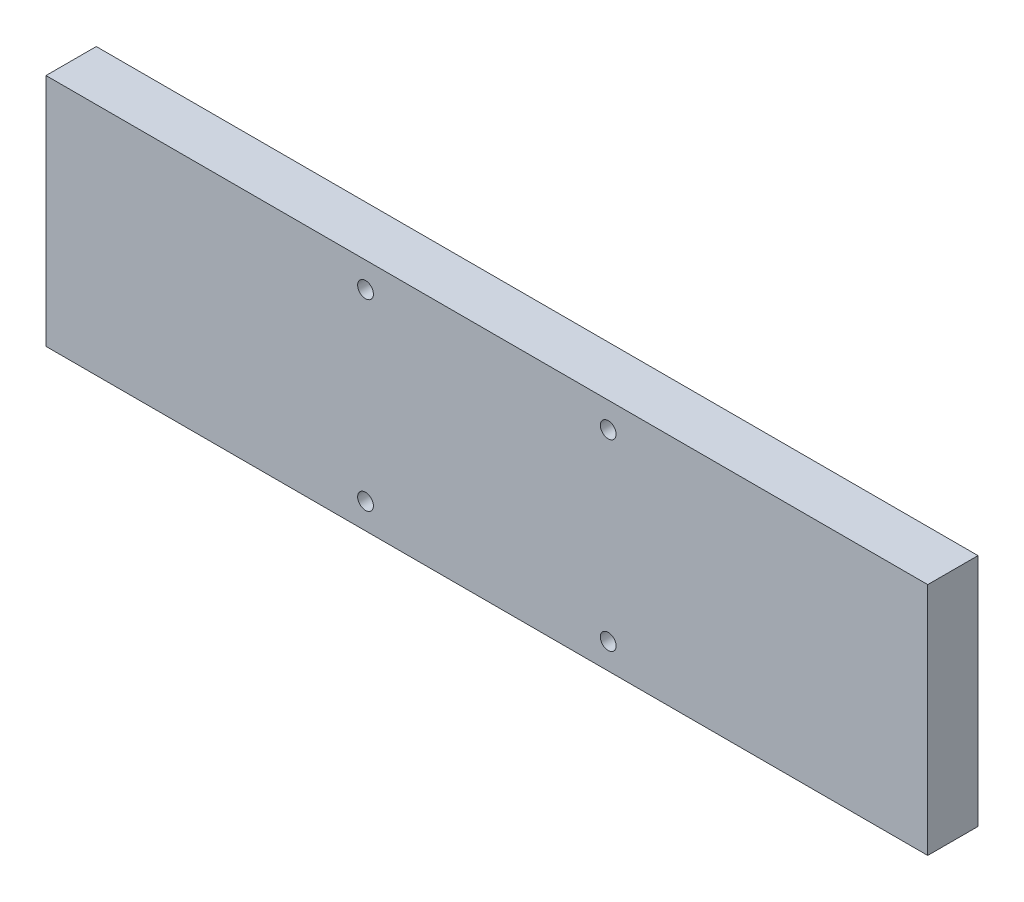
ISO-10303-21;
HEADER;
FILE_DESCRIPTION(('STEP AP214'),'2;1');
FILE_NAME('part.step','',(''),(''),'','','');
FILE_SCHEMA(('AUTOMOTIVE_DESIGN { 1 0 10303 214 1 1 1 1 }'));
ENDSEC;
DATA;
#1=APPLICATION_CONTEXT('core data for automotive mechanical design processes');
#2=APPLICATION_PROTOCOL_DEFINITION('international standard','automotive_design',2000,#1);
#3=PRODUCT_CONTEXT('',#1,'mechanical');
#4=PRODUCT('Part','Part','',(#3));
#5=PRODUCT_RELATED_PRODUCT_CATEGORY('part','',(#4));
#6=PRODUCT_DEFINITION_FORMATION('','',#4);
#7=PRODUCT_DEFINITION_CONTEXT('part definition',#1,'design');
#8=PRODUCT_DEFINITION('design','',#6,#7);
#9=PRODUCT_DEFINITION_SHAPE('','',#8);
#10=(LENGTH_UNIT() NAMED_UNIT(*) SI_UNIT(.MILLI.,.METRE.));
#11=(NAMED_UNIT(*) PLANE_ANGLE_UNIT() SI_UNIT($,.RADIAN.));
#12=(NAMED_UNIT(*) SI_UNIT($,.STERADIAN.) SOLID_ANGLE_UNIT());
#13=UNCERTAINTY_MEASURE_WITH_UNIT(LENGTH_MEASURE(1.E-05),#10,'distance_accuracy_value','');
#14=(GEOMETRIC_REPRESENTATION_CONTEXT(3) GLOBAL_UNCERTAINTY_ASSIGNED_CONTEXT((#13)) GLOBAL_UNIT_ASSIGNED_CONTEXT((#10,
#11,#12)) REPRESENTATION_CONTEXT('',''));
#15=CARTESIAN_POINT('',(0.,0.,0.));
#16=DIRECTION('',(0.,0.,1.));
#17=DIRECTION('',(1.,0.,0.));
#18=AXIS2_PLACEMENT_3D('',#15,#16,#17);
#19=CARTESIAN_POINT('',(5029.02825509727,1881.72377540396,18.64));
#20=DIRECTION('',(1.,0.,0.));
#21=DIRECTION('',(0.,0.,-1.));
#22=AXIS2_PLACEMENT_3D('',#19,#20,#21);
#23=PLANE('',#22);
#24=DIRECTION('',(0.,-1.,0.));
#25=VECTOR('',#24,1.);
#26=CARTESIAN_POINT('',(5029.02825509727,1881.72377540396,0.));
#27=LINE('',#26,#25);
#28=CARTESIAN_POINT('',(5029.02825509727,1881.72377540396,0.));
#29=VERTEX_POINT('',#28);
#30=CARTESIAN_POINT('',(5029.02825509727,1794.72377540396,0.));
#31=VERTEX_POINT('',#30);
#32=EDGE_CURVE('E96',#29,#31,#27,.T.);
#33=ORIENTED_EDGE('',*,*,#32,.T.);
#34=DIRECTION('',(0.,0.,-1.));
#35=VECTOR('',#34,1.);
#36=CARTESIAN_POINT('',(5029.02825509727,1794.72377540396,18.64));
#37=LINE('',#36,#35);
#38=CARTESIAN_POINT('',(5029.02825509727,1794.72377540396,18.64));
#39=VERTEX_POINT('',#38);
#40=EDGE_CURVE('E11',#39,#31,#37,.T.);
#41=ORIENTED_EDGE('',*,*,#40,.F.);
#42=DIRECTION('',(0.,-1.,0.));
#43=VECTOR('',#42,1.);
#44=CARTESIAN_POINT('',(5029.02825509727,1881.72377540396,18.64));
#45=LINE('',#44,#43);
#46=CARTESIAN_POINT('',(5029.02825509727,1881.72377540396,18.64));
#47=VERTEX_POINT('',#46);
#48=EDGE_CURVE('E84',#47,#39,#45,.T.);
#49=ORIENTED_EDGE('',*,*,#48,.F.);
#50=DIRECTION('',(0.,0.,-1.));
#51=VECTOR('',#50,1.);
#52=CARTESIAN_POINT('',(5029.02825509727,1881.72377540396,18.64));
#53=LINE('',#52,#51);
#54=EDGE_CURVE('E92',#47,#29,#53,.T.);
#55=ORIENTED_EDGE('',*,*,#54,.T.);
#56=EDGE_LOOP('',(#33,#41,#49,#55));
#57=FACE_BOUND('',#56,.T.);
#58=ADVANCED_FACE('F33',(#57),#23,.F.);
#59=CARTESIAN_POINT('',(5029.02825509727,1794.72377540396,18.64));
#60=DIRECTION('',(0.,1.,0.));
#61=DIRECTION('',(0.,0.,1.));
#62=AXIS2_PLACEMENT_3D('',#59,#60,#61);
#63=PLANE('',#62);
#64=DIRECTION('',(1.,0.,0.));
#65=VECTOR('',#64,1.);
#66=CARTESIAN_POINT('',(5029.02825509727,1794.72377540396,0.));
#67=LINE('',#66,#65);
#68=CARTESIAN_POINT('',(5356.02825509727,1794.72377540396,0.));
#69=VERTEX_POINT('',#68);
#70=EDGE_CURVE('E88',#31,#69,#67,.T.);
#71=ORIENTED_EDGE('',*,*,#70,.T.);
#72=DIRECTION('',(0.,0.,-1.));
#73=VECTOR('',#72,1.);
#74=CARTESIAN_POINT('',(5356.02825509727,1794.72377540396,18.64));
#75=LINE('',#74,#73);
#76=CARTESIAN_POINT('',(5356.02825509727,1794.72377540396,18.64));
#77=VERTEX_POINT('',#76);
#78=EDGE_CURVE('E41',#77,#69,#75,.T.);
#79=ORIENTED_EDGE('',*,*,#78,.F.);
#80=DIRECTION('',(1.,0.,0.));
#81=VECTOR('',#80,1.);
#82=CARTESIAN_POINT('',(5029.02825509727,1794.72377540396,18.64));
#83=LINE('',#82,#81);
#84=EDGE_CURVE('E79',#39,#77,#83,.T.);
#85=ORIENTED_EDGE('',*,*,#84,.F.);
#86=ORIENTED_EDGE('',*,*,#40,.T.);
#87=EDGE_LOOP('',(#71,#79,#85,#86));
#88=FACE_BOUND('',#87,.T.);
#89=ADVANCED_FACE('F87',(#88),#63,.F.);
#90=CARTESIAN_POINT('',(5356.02825509727,1881.72377540396,18.64));
#91=DIRECTION('',(-1.,0.,0.));
#92=DIRECTION('',(0.,0.,1.));
#93=AXIS2_PLACEMENT_3D('',#90,#91,#92);
#94=PLANE('',#93);
#95=DIRECTION('',(0.,1.,0.));
#96=VECTOR('',#95,1.);
#97=CARTESIAN_POINT('',(5356.02825509727,1881.72377540396,0.));
#98=LINE('',#97,#96);
#99=CARTESIAN_POINT('',(5356.02825509727,1881.72377540396,0.));
#100=VERTEX_POINT('',#99);
#101=EDGE_CURVE('E66',#69,#100,#98,.T.);
#102=ORIENTED_EDGE('',*,*,#101,.T.);
#103=DIRECTION('',(0.,0.,-1.));
#104=VECTOR('',#103,1.);
#105=CARTESIAN_POINT('',(5356.02825509727,1881.72377540396,18.64));
#106=LINE('',#105,#104);
#107=CARTESIAN_POINT('',(5356.02825509727,1881.72377540396,18.64));
#108=VERTEX_POINT('',#107);
#109=EDGE_CURVE('E89',#108,#100,#106,.T.);
#110=ORIENTED_EDGE('',*,*,#109,.F.);
#111=DIRECTION('',(0.,1.,0.));
#112=VECTOR('',#111,1.);
#113=CARTESIAN_POINT('',(5356.02825509727,1881.72377540396,18.64));
#114=LINE('',#113,#112);
#115=EDGE_CURVE('E82',#77,#108,#114,.T.);
#116=ORIENTED_EDGE('',*,*,#115,.F.);
#117=ORIENTED_EDGE('',*,*,#78,.T.);
#118=EDGE_LOOP('',(#102,#110,#116,#117));
#119=FACE_BOUND('',#118,.T.);
#120=ADVANCED_FACE('F90',(#119),#94,.F.);
#121=CARTESIAN_POINT('',(5029.02825509727,1881.72377540396,18.64));
#122=DIRECTION('',(0.,-1.,0.));
#123=DIRECTION('',(0.,0.,-1.));
#124=AXIS2_PLACEMENT_3D('',#121,#122,#123);
#125=PLANE('',#124);
#126=DIRECTION('',(-1.,0.,0.));
#127=VECTOR('',#126,1.);
#128=CARTESIAN_POINT('',(5029.02825509727,1881.72377540396,0.));
#129=LINE('',#128,#127);
#130=EDGE_CURVE('E72',#100,#29,#129,.T.);
#131=ORIENTED_EDGE('',*,*,#130,.T.);
#132=ORIENTED_EDGE('',*,*,#54,.F.);
#133=DIRECTION('',(-1.,0.,0.));
#134=VECTOR('',#133,1.);
#135=CARTESIAN_POINT('',(5029.02825509727,1881.72377540396,18.64));
#136=LINE('',#135,#134);
#137=EDGE_CURVE('E49',#108,#47,#136,.T.);
#138=ORIENTED_EDGE('',*,*,#137,.F.);
#139=ORIENTED_EDGE('',*,*,#109,.T.);
#140=EDGE_LOOP('',(#131,#132,#138,#139));
#141=FACE_BOUND('',#140,.T.);
#142=ADVANCED_FACE('F104',(#141),#125,.F.);
#143=CARTESIAN_POINT('',(0.,0.,18.64));
#144=DIRECTION('',(0.,0.,1.));
#145=DIRECTION('',(1.,0.,0.));
#146=AXIS2_PLACEMENT_3D('',#143,#144,#145);
#147=PLANE('',#146);
#148=CARTESIAN_POINT('',(5147.52825509727,1872.22377540396,18.64));
#149=DIRECTION('',(0.,0.,1.));
#150=DIRECTION('',(1.,0.,0.));
#151=AXIS2_PLACEMENT_3D('',#148,#149,#150);
#152=CIRCLE('',#151,2.92500000000008);
#153=CARTESIAN_POINT('',(5150.45325509727,1872.22377540396,18.64));
#154=VERTEX_POINT('',#153);
#155=EDGE_CURVE('E116',#154,#154,#152,.T.);
#156=ORIENTED_EDGE('',*,*,#155,.F.);
#157=EDGE_LOOP('',(#156));
#158=FACE_BOUND('',#157,.T.);
#159=CARTESIAN_POINT('',(5237.52825509727,1872.22377540396,18.64));
#160=DIRECTION('',(0.,0.,1.));
#161=DIRECTION('',(1.,0.,0.));
#162=AXIS2_PLACEMENT_3D('',#159,#160,#161);
#163=CIRCLE('',#162,2.92500000000008);
#164=CARTESIAN_POINT('',(5240.45325509727,1872.22377540396,18.64));
#165=VERTEX_POINT('',#164);
#166=EDGE_CURVE('E122',#165,#165,#163,.T.);
#167=ORIENTED_EDGE('',*,*,#166,.F.);
#168=EDGE_LOOP('',(#167));
#169=FACE_BOUND('',#168,.T.);
#170=CARTESIAN_POINT('',(5237.52825509727,1804.22377540396,18.64));
#171=DIRECTION('',(0.,0.,1.));
#172=DIRECTION('',(1.,0.,0.));
#173=AXIS2_PLACEMENT_3D('',#170,#171,#172);
#174=CIRCLE('',#173,2.92500000000008);
#175=CARTESIAN_POINT('',(5240.45325509727,1804.22377540396,18.64));
#176=VERTEX_POINT('',#175);
#177=EDGE_CURVE('E128',#176,#176,#174,.T.);
#178=ORIENTED_EDGE('',*,*,#177,.F.);
#179=EDGE_LOOP('',(#178));
#180=FACE_BOUND('',#179,.T.);
#181=CARTESIAN_POINT('',(5147.52825509727,1804.22377540396,18.64));
#182=DIRECTION('',(0.,0.,1.));
#183=DIRECTION('',(1.,0.,0.));
#184=AXIS2_PLACEMENT_3D('',#181,#182,#183);
#185=CIRCLE('',#184,2.92500000000008);
#186=CARTESIAN_POINT('',(5150.45325509727,1804.22377540396,18.64));
#187=VERTEX_POINT('',#186);
#188=EDGE_CURVE('E110',#187,#187,#185,.T.);
#189=ORIENTED_EDGE('',*,*,#188,.F.);
#190=EDGE_LOOP('',(#189));
#191=FACE_BOUND('',#190,.T.);
#192=ORIENTED_EDGE('',*,*,#48,.T.);
#193=ORIENTED_EDGE('',*,*,#84,.T.);
#194=ORIENTED_EDGE('',*,*,#115,.T.);
#195=ORIENTED_EDGE('',*,*,#137,.T.);
#196=EDGE_LOOP('',(#192,#193,#194,#195));
#197=FACE_BOUND('',#196,.T.);
#198=ADVANCED_FACE('F80',(#158,#169,#180,#191,#197),#147,.T.);
#199=CARTESIAN_POINT('',(0.,0.,0.));
#200=DIRECTION('',(0.,0.,1.));
#201=DIRECTION('',(1.,0.,0.));
#202=AXIS2_PLACEMENT_3D('',#199,#200,#201);
#203=PLANE('',#202);
#204=CARTESIAN_POINT('',(5147.52825509727,1872.22377540396,0.));
#205=DIRECTION('',(0.,0.,1.));
#206=DIRECTION('',(1.,0.,0.));
#207=AXIS2_PLACEMENT_3D('',#204,#205,#206);
#208=CIRCLE('',#207,2.92500000000008);
#209=CARTESIAN_POINT('',(5150.45325509727,1872.22377540396,0.));
#210=VERTEX_POINT('',#209);
#211=EDGE_CURVE('E119',#210,#210,#208,.T.);
#212=ORIENTED_EDGE('',*,*,#211,.T.);
#213=EDGE_LOOP('',(#212));
#214=FACE_BOUND('',#213,.T.);
#215=CARTESIAN_POINT('',(5237.52825509727,1872.22377540396,0.));
#216=DIRECTION('',(0.,0.,1.));
#217=DIRECTION('',(1.,0.,0.));
#218=AXIS2_PLACEMENT_3D('',#215,#216,#217);
#219=CIRCLE('',#218,2.92500000000008);
#220=CARTESIAN_POINT('',(5240.45325509727,1872.22377540396,0.));
#221=VERTEX_POINT('',#220);
#222=EDGE_CURVE('E125',#221,#221,#219,.T.);
#223=ORIENTED_EDGE('',*,*,#222,.T.);
#224=EDGE_LOOP('',(#223));
#225=FACE_BOUND('',#224,.T.);
#226=CARTESIAN_POINT('',(5237.52825509727,1804.22377540396,0.));
#227=DIRECTION('',(0.,0.,1.));
#228=DIRECTION('',(1.,0.,0.));
#229=AXIS2_PLACEMENT_3D('',#226,#227,#228);
#230=CIRCLE('',#229,2.92500000000008);
#231=CARTESIAN_POINT('',(5240.45325509727,1804.22377540396,0.));
#232=VERTEX_POINT('',#231);
#233=EDGE_CURVE('E113',#232,#232,#230,.T.);
#234=ORIENTED_EDGE('',*,*,#233,.T.);
#235=EDGE_LOOP('',(#234));
#236=FACE_BOUND('',#235,.T.);
#237=CARTESIAN_POINT('',(5147.52825509727,1804.22377540396,0.));
#238=DIRECTION('',(0.,0.,1.));
#239=DIRECTION('',(1.,0.,0.));
#240=AXIS2_PLACEMENT_3D('',#237,#238,#239);
#241=CIRCLE('',#240,2.92500000000008);
#242=CARTESIAN_POINT('',(5150.45325509727,1804.22377540396,0.));
#243=VERTEX_POINT('',#242);
#244=EDGE_CURVE('E99',#243,#243,#241,.T.);
#245=ORIENTED_EDGE('',*,*,#244,.T.);
#246=EDGE_LOOP('',(#245));
#247=FACE_BOUND('',#246,.T.);
#248=ORIENTED_EDGE('',*,*,#32,.F.);
#249=ORIENTED_EDGE('',*,*,#130,.F.);
#250=ORIENTED_EDGE('',*,*,#101,.F.);
#251=ORIENTED_EDGE('',*,*,#70,.F.);
#252=EDGE_LOOP('',(#248,#249,#250,#251));
#253=FACE_BOUND('',#252,.T.);
#254=ADVANCED_FACE('F107',(#214,#225,#236,#247,#253),#203,.F.);
#255=CARTESIAN_POINT('',(5147.52825509727,1804.22377540396,0.));
#256=DIRECTION('',(0.,0.,1.));
#257=DIRECTION('',(1.,0.,0.));
#258=AXIS2_PLACEMENT_3D('',#255,#256,#257);
#259=CYLINDRICAL_SURFACE('',#258,2.92500000000008);
#260=ORIENTED_EDGE('',*,*,#244,.F.);
#261=EDGE_LOOP('',(#260));
#262=FACE_BOUND('',#261,.T.);
#263=ORIENTED_EDGE('',*,*,#188,.T.);
#264=EDGE_LOOP('',(#263));
#265=FACE_BOUND('',#264,.T.);
#266=ADVANCED_FACE('F140',(#262,#265),#259,.F.);
#267=CARTESIAN_POINT('',(5237.52825509727,1804.22377540396,0.));
#268=DIRECTION('',(0.,0.,1.));
#269=DIRECTION('',(1.,0.,0.));
#270=AXIS2_PLACEMENT_3D('',#267,#268,#269);
#271=CYLINDRICAL_SURFACE('',#270,2.92500000000008);
#272=ORIENTED_EDGE('',*,*,#233,.F.);
#273=EDGE_LOOP('',(#272));
#274=FACE_BOUND('',#273,.T.);
#275=ORIENTED_EDGE('',*,*,#177,.T.);
#276=EDGE_LOOP('',(#275));
#277=FACE_BOUND('',#276,.T.);
#278=ADVANCED_FACE('F136',(#274,#277),#271,.F.);
#279=CARTESIAN_POINT('',(5237.52825509727,1872.22377540396,0.));
#280=DIRECTION('',(0.,0.,1.));
#281=DIRECTION('',(1.,0.,0.));
#282=AXIS2_PLACEMENT_3D('',#279,#280,#281);
#283=CYLINDRICAL_SURFACE('',#282,2.92500000000008);
#284=ORIENTED_EDGE('',*,*,#222,.F.);
#285=EDGE_LOOP('',(#284));
#286=FACE_BOUND('',#285,.T.);
#287=ORIENTED_EDGE('',*,*,#166,.T.);
#288=EDGE_LOOP('',(#287));
#289=FACE_BOUND('',#288,.T.);
#290=ADVANCED_FACE('F139',(#286,#289),#283,.F.);
#291=CARTESIAN_POINT('',(5147.52825509727,1872.22377540396,0.));
#292=DIRECTION('',(0.,0.,1.));
#293=DIRECTION('',(1.,0.,0.));
#294=AXIS2_PLACEMENT_3D('',#291,#292,#293);
#295=CYLINDRICAL_SURFACE('',#294,2.92500000000008);
#296=ORIENTED_EDGE('',*,*,#211,.F.);
#297=EDGE_LOOP('',(#296));
#298=FACE_BOUND('',#297,.T.);
#299=ORIENTED_EDGE('',*,*,#155,.T.);
#300=EDGE_LOOP('',(#299));
#301=FACE_BOUND('',#300,.T.);
#302=ADVANCED_FACE('F201',(#298,#301),#295,.F.);
#303=CLOSED_SHELL('',(#58,#89,#120,#142,#198,#254,#266,#278,#290,#302));
#304=MANIFOLD_SOLID_BREP('B2',#303);
#305=ADVANCED_BREP_SHAPE_REPRESENTATION('',(#18,#304),#14);
#306=SHAPE_DEFINITION_REPRESENTATION(#9,#305);
ENDSEC;
END-ISO-10303-21;
